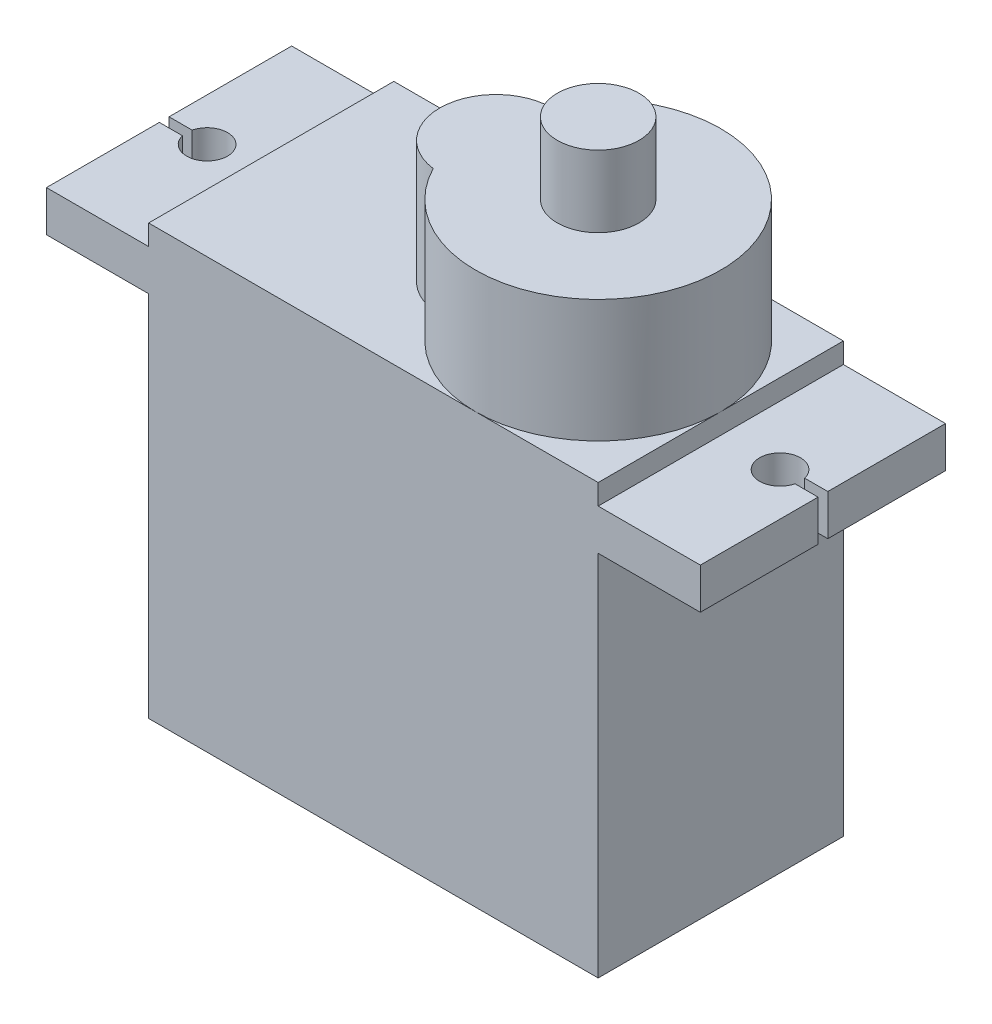
ISO-10303-21;
HEADER;
FILE_DESCRIPTION(('STEP AP214'),'2;1');
FILE_NAME('part.step','',(''),(''),'','','');
FILE_SCHEMA(('AUTOMOTIVE_DESIGN { 1 0 10303 214 1 1 1 1 }'));
ENDSEC;
DATA;
#1=APPLICATION_CONTEXT('core data for automotive mechanical design processes');
#2=APPLICATION_PROTOCOL_DEFINITION('international standard','automotive_design',2000,#1);
#3=PRODUCT_CONTEXT('',#1,'mechanical');
#4=PRODUCT('Part','Part','',(#3));
#5=PRODUCT_RELATED_PRODUCT_CATEGORY('part','',(#4));
#6=PRODUCT_DEFINITION_FORMATION('','',#4);
#7=PRODUCT_DEFINITION_CONTEXT('part definition',#1,'design');
#8=PRODUCT_DEFINITION('design','',#6,#7);
#9=PRODUCT_DEFINITION_SHAPE('','',#8);
#10=(LENGTH_UNIT() NAMED_UNIT(*) SI_UNIT(.MILLI.,.METRE.));
#11=(NAMED_UNIT(*) PLANE_ANGLE_UNIT() SI_UNIT($,.RADIAN.));
#12=(NAMED_UNIT(*) SI_UNIT($,.STERADIAN.) SOLID_ANGLE_UNIT());
#13=UNCERTAINTY_MEASURE_WITH_UNIT(LENGTH_MEASURE(1.E-05),#10,'distance_accuracy_value','');
#14=(GEOMETRIC_REPRESENTATION_CONTEXT(3) GLOBAL_UNCERTAINTY_ASSIGNED_CONTEXT((#13)) GLOBAL_UNIT_ASSIGNED_CONTEXT((#10,
#11,#12)) REPRESENTATION_CONTEXT('',''));
#15=CARTESIAN_POINT('',(0.,0.,0.));
#16=DIRECTION('',(0.,0.,1.));
#17=DIRECTION('',(1.,0.,0.));
#18=AXIS2_PLACEMENT_3D('',#15,#16,#17);
#19=CARTESIAN_POINT('',(-11.,11.,12.));
#20=DIRECTION('',(0.,-1.,0.));
#21=DIRECTION('',(0.,0.,-1.));
#22=AXIS2_PLACEMENT_3D('',#19,#20,#21);
#23=PLANE('',#22);
#24=CARTESIAN_POINT('',(0.,11.,6.));
#25=DIRECTION('',(0.,1.,0.));
#26=DIRECTION('',(0.,0.,1.));
#27=AXIS2_PLACEMENT_3D('',#24,#25,#26);
#28=CIRCLE('',#27,2.75);
#29=CARTESIAN_POINT('',(-0.343750000000005,11.,3.27156896046464));
#30=VERTEX_POINT('',#29);
#31=CARTESIAN_POINT('',(-0.343750000000006,11.,8.72843103953536));
#32=VERTEX_POINT('',#31);
#33=EDGE_CURVE('E215',#30,#32,#28,.T.);
#34=ORIENTED_EDGE('',*,*,#33,.F.);
#35=CARTESIAN_POINT('',(5.,11.,6.));
#36=DIRECTION('',(0.,1.,0.));
#37=DIRECTION('',(0.,0.,1.));
#38=AXIS2_PLACEMENT_3D('',#35,#36,#37);
#39=CIRCLE('',#38,6.);
#40=CARTESIAN_POINT('',(5.,11.,0.));
#41=VERTEX_POINT('',#40);
#42=EDGE_CURVE('E367',#41,#30,#39,.T.);
#43=ORIENTED_EDGE('',*,*,#42,.F.);
#44=DIRECTION('',(-1.,0.,0.));
#45=VECTOR('',#44,1.);
#46=CARTESIAN_POINT('',(-11.,11.,0.));
#47=LINE('',#46,#45);
#48=CARTESIAN_POINT('',(-11.,11.,0.));
#49=VERTEX_POINT('',#48);
#50=EDGE_CURVE('E304',#41,#49,#47,.T.);
#51=ORIENTED_EDGE('',*,*,#50,.T.);
#52=DIRECTION('',(0.,0.,-1.));
#53=VECTOR('',#52,1.);
#54=CARTESIAN_POINT('',(-11.,11.,12.));
#55=LINE('',#54,#53);
#56=CARTESIAN_POINT('',(-11.,11.,12.));
#57=VERTEX_POINT('',#56);
#58=EDGE_CURVE('E358',#57,#49,#55,.T.);
#59=ORIENTED_EDGE('',*,*,#58,.F.);
#60=DIRECTION('',(-1.,0.,0.));
#61=VECTOR('',#60,1.);
#62=CARTESIAN_POINT('',(-11.,11.,12.));
#63=LINE('',#62,#61);
#64=CARTESIAN_POINT('',(5.,11.,12.));
#65=VERTEX_POINT('',#64);
#66=EDGE_CURVE('E276',#65,#57,#63,.T.);
#67=ORIENTED_EDGE('',*,*,#66,.F.);
#68=EDGE_CURVE('E49',#32,#65,#39,.T.);
#69=ORIENTED_EDGE('',*,*,#68,.F.);
#70=EDGE_LOOP('',(#34,#43,#51,#59,#67,#69));
#71=FACE_BOUND('',#70,.T.);
#72=ADVANCED_FACE('F38',(#71),#23,.F.);
#73=CARTESIAN_POINT('',(11.,11.,6.));
#74=VERTEX_POINT('',#73);
#75=EDGE_CURVE('E11',#65,#74,#39,.T.);
#76=ORIENTED_EDGE('',*,*,#75,.F.);
#77=CARTESIAN_POINT('',(11.,11.,12.));
#78=VERTEX_POINT('',#77);
#79=EDGE_CURVE('E277',#78,#65,#63,.T.);
#80=ORIENTED_EDGE('',*,*,#79,.F.);
#81=DIRECTION('',(0.,0.,-1.));
#82=VECTOR('',#81,1.);
#83=CARTESIAN_POINT('',(11.,11.,12.));
#84=LINE('',#83,#82);
#85=EDGE_CURVE('E361',#78,#74,#84,.T.);
#86=ORIENTED_EDGE('',*,*,#85,.T.);
#87=EDGE_LOOP('',(#76,#80,#86));
#88=FACE_BOUND('',#87,.T.);
#89=ADVANCED_FACE('F412',(#88),#23,.F.);
#90=CARTESIAN_POINT('',(-16.,9.99999999999999,12.));
#91=DIRECTION('',(1.,0.,0.));
#92=DIRECTION('',(0.,0.,-1.));
#93=AXIS2_PLACEMENT_3D('',#90,#91,#92);
#94=PLANE('',#93);
#95=DIRECTION('',(0.,0.,-1.));
#96=VECTOR('',#95,1.);
#97=CARTESIAN_POINT('',(-16.,9.99999999999999,12.));
#98=LINE('',#97,#96);
#99=CARTESIAN_POINT('',(-16.,9.99999999999999,12.));
#100=VERTEX_POINT('',#99);
#101=CARTESIAN_POINT('',(-16.,9.99999999999998,6.47573964591907));
#102=VERTEX_POINT('',#101);
#103=EDGE_CURVE('E352',#100,#102,#98,.T.);
#104=ORIENTED_EDGE('',*,*,#103,.T.);
#105=DIRECTION('',(0.,1.,0.));
#106=VECTOR('',#105,1.);
#107=CARTESIAN_POINT('',(-16.,-10.001,6.47573964591907));
#108=LINE('',#107,#106);
#109=CARTESIAN_POINT('',(-16.,7.99999999999999,6.47573964591907));
#110=VERTEX_POINT('',#109);
#111=EDGE_CURVE('E241',#110,#102,#108,.T.);
#112=ORIENTED_EDGE('',*,*,#111,.F.);
#113=DIRECTION('',(0.,0.,-1.));
#114=VECTOR('',#113,1.);
#115=CARTESIAN_POINT('',(-16.,7.99999999999999,12.));
#116=LINE('',#115,#114);
#117=CARTESIAN_POINT('',(-16.,7.99999999999999,12.));
#118=VERTEX_POINT('',#117);
#119=EDGE_CURVE('E348',#118,#110,#116,.T.);
#120=ORIENTED_EDGE('',*,*,#119,.F.);
#121=DIRECTION('',(0.,-1.,0.));
#122=VECTOR('',#121,1.);
#123=CARTESIAN_POINT('',(-16.,9.99999999999999,12.));
#124=LINE('',#123,#122);
#125=EDGE_CURVE('E284',#100,#118,#124,.T.);
#126=ORIENTED_EDGE('',*,*,#125,.F.);
#127=EDGE_LOOP('',(#104,#112,#120,#126));
#128=FACE_BOUND('',#127,.T.);
#129=ADVANCED_FACE('F417',(#128),#94,.F.);
#130=CARTESIAN_POINT('',(16.,9.99999999999999,12.));
#131=DIRECTION('',(-1.,0.,0.));
#132=DIRECTION('',(0.,0.,1.));
#133=AXIS2_PLACEMENT_3D('',#130,#131,#132);
#134=PLANE('',#133);
#135=DIRECTION('',(0.,0.,-1.));
#136=VECTOR('',#135,1.);
#137=CARTESIAN_POINT('',(16.,9.99999999999999,12.));
#138=LINE('',#137,#136);
#139=CARTESIAN_POINT('',(16.,10.,5.76213017704046));
#140=VERTEX_POINT('',#139);
#141=CARTESIAN_POINT('',(16.,9.99999999999999,0.));
#142=VERTEX_POINT('',#141);
#143=EDGE_CURVE('E298',#140,#142,#138,.T.);
#144=ORIENTED_EDGE('',*,*,#143,.F.);
#145=DIRECTION('',(0.,1.,0.));
#146=VECTOR('',#145,1.);
#147=CARTESIAN_POINT('',(16.,-10.001,5.76213017704046));
#148=LINE('',#147,#146);
#149=CARTESIAN_POINT('',(16.,7.99999999999999,5.76213017704046));
#150=VERTEX_POINT('',#149);
#151=EDGE_CURVE('E262',#150,#140,#148,.T.);
#152=ORIENTED_EDGE('',*,*,#151,.F.);
#153=DIRECTION('',(0.,0.,-1.));
#154=VECTOR('',#153,1.);
#155=CARTESIAN_POINT('',(16.,7.99999999999999,12.));
#156=LINE('',#155,#154);
#157=CARTESIAN_POINT('',(16.,7.99999999999999,0.));
#158=VERTEX_POINT('',#157);
#159=EDGE_CURVE('E331',#150,#158,#156,.T.);
#160=ORIENTED_EDGE('',*,*,#159,.T.);
#161=DIRECTION('',(0.,1.,0.));
#162=VECTOR('',#161,1.);
#163=CARTESIAN_POINT('',(16.,9.99999999999999,0.));
#164=LINE('',#163,#162);
#165=EDGE_CURVE('E274',#158,#142,#164,.T.);
#166=ORIENTED_EDGE('',*,*,#165,.T.);
#167=EDGE_LOOP('',(#144,#152,#160,#166));
#168=FACE_BOUND('',#167,.T.);
#169=ADVANCED_FACE('F428',(#168),#134,.F.);
#170=CARTESIAN_POINT('',(16.,9.99999999999999,12.));
#171=DIRECTION('',(0.,-1.,0.));
#172=DIRECTION('',(0.,0.,-1.));
#173=AXIS2_PLACEMENT_3D('',#170,#171,#172);
#174=PLANE('',#173);
#175=CARTESIAN_POINT('',(13.9005012794919,10.,6.));
#176=DIRECTION('',(0.,1.,0.));
#177=DIRECTION('',(1.,0.,0.));
#178=AXIS2_PLACEMENT_3D('',#175,#176,#177);
#179=CIRCLE('',#178,1.);
#180=CARTESIAN_POINT('',(14.8717983233076,10.,5.76213017704046));
#181=VERTEX_POINT('',#180);
#182=CARTESIAN_POINT('',(14.8717983233076,10.,6.23786982295953));
#183=VERTEX_POINT('',#182);
#184=EDGE_CURVE('E251',#181,#183,#179,.T.);
#185=ORIENTED_EDGE('',*,*,#184,.F.);
#186=DIRECTION('',(-1.,0.,0.));
#187=VECTOR('',#186,1.);
#188=CARTESIAN_POINT('',(16.,10.,5.76213017704046));
#189=LINE('',#188,#187);
#190=EDGE_CURVE('E256',#140,#181,#189,.T.);
#191=ORIENTED_EDGE('',*,*,#190,.F.);
#192=ORIENTED_EDGE('',*,*,#143,.T.);
#193=DIRECTION('',(-1.,0.,0.));
#194=VECTOR('',#193,1.);
#195=CARTESIAN_POINT('',(16.,9.99999999999999,0.));
#196=LINE('',#195,#194);
#197=CARTESIAN_POINT('',(11.,9.99999999999999,0.));
#198=VERTEX_POINT('',#197);
#199=EDGE_CURVE('E248',#142,#198,#196,.T.);
#200=ORIENTED_EDGE('',*,*,#199,.T.);
#201=DIRECTION('',(0.,0.,-1.));
#202=VECTOR('',#201,1.);
#203=CARTESIAN_POINT('',(11.,9.99999999999999,12.));
#204=LINE('',#203,#202);
#205=CARTESIAN_POINT('',(11.,9.99999999999999,12.));
#206=VERTEX_POINT('',#205);
#207=EDGE_CURVE('E42',#206,#198,#204,.T.);
#208=ORIENTED_EDGE('',*,*,#207,.F.);
#209=DIRECTION('',(-1.,0.,0.));
#210=VECTOR('',#209,1.);
#211=CARTESIAN_POINT('',(16.,9.99999999999999,12.));
#212=LINE('',#211,#210);
#213=CARTESIAN_POINT('',(16.,9.99999999999999,12.));
#214=VERTEX_POINT('',#213);
#215=EDGE_CURVE('E270',#214,#206,#212,.T.);
#216=ORIENTED_EDGE('',*,*,#215,.F.);
#217=CARTESIAN_POINT('',(16.,9.99999999999999,6.23786982295953));
#218=VERTEX_POINT('',#217);
#219=EDGE_CURVE('E328',#214,#218,#138,.T.);
#220=ORIENTED_EDGE('',*,*,#219,.T.);
#221=DIRECTION('',(1.,0.,0.));
#222=VECTOR('',#221,1.);
#223=CARTESIAN_POINT('',(16.,10.,6.23786982295953));
#224=LINE('',#223,#222);
#225=EDGE_CURVE('E254',#183,#218,#224,.T.);
#226=ORIENTED_EDGE('',*,*,#225,.F.);
#227=EDGE_LOOP('',(#185,#191,#192,#200,#208,#216,#220,#226));
#228=FACE_BOUND('',#227,.T.);
#229=ADVANCED_FACE('F40',(#228),#174,.F.);
#230=CARTESIAN_POINT('',(11.,9.99999999999999,12.));
#231=DIRECTION('',(-1.,0.,0.));
#232=DIRECTION('',(0.,-1.,0.));
#233=AXIS2_PLACEMENT_3D('',#230,#231,#232);
#234=PLANE('',#233);
#235=DIRECTION('',(0.,1.,0.));
#236=VECTOR('',#235,1.);
#237=CARTESIAN_POINT('',(11.,9.99999999999999,0.));
#238=LINE('',#237,#236);
#239=CARTESIAN_POINT('',(11.,11.,0.));
#240=VERTEX_POINT('',#239);
#241=EDGE_CURVE('E301',#198,#240,#238,.T.);
#242=ORIENTED_EDGE('',*,*,#241,.T.);
#243=EDGE_CURVE('E360',#74,#240,#84,.T.);
#244=ORIENTED_EDGE('',*,*,#243,.F.);
#245=ORIENTED_EDGE('',*,*,#85,.F.);
#246=DIRECTION('',(0.,1.,0.));
#247=VECTOR('',#246,1.);
#248=CARTESIAN_POINT('',(11.,9.99999999999999,12.));
#249=LINE('',#248,#247);
#250=EDGE_CURVE('E273',#206,#78,#249,.T.);
#251=ORIENTED_EDGE('',*,*,#250,.F.);
#252=ORIENTED_EDGE('',*,*,#207,.T.);
#253=EDGE_LOOP('',(#242,#244,#245,#251,#252));
#254=FACE_BOUND('',#253,.T.);
#255=ADVANCED_FACE('F371',(#254),#234,.F.);
#256=EDGE_CURVE('E47',#74,#41,#39,.T.);
#257=ORIENTED_EDGE('',*,*,#256,.F.);
#258=ORIENTED_EDGE('',*,*,#243,.T.);
#259=EDGE_CURVE('E305',#240,#41,#47,.T.);
#260=ORIENTED_EDGE('',*,*,#259,.T.);
#261=EDGE_LOOP('',(#257,#258,#260));
#262=FACE_BOUND('',#261,.T.);
#263=ADVANCED_FACE('F368',(#262),#23,.F.);
#264=CARTESIAN_POINT('',(-11.,9.99999999999999,12.));
#265=DIRECTION('',(1.,0.,0.));
#266=DIRECTION('',(0.,1.,0.));
#267=AXIS2_PLACEMENT_3D('',#264,#265,#266);
#268=PLANE('',#267);
#269=DIRECTION('',(0.,-1.,0.));
#270=VECTOR('',#269,1.);
#271=CARTESIAN_POINT('',(-11.,9.99999999999999,0.));
#272=LINE('',#271,#270);
#273=CARTESIAN_POINT('',(-11.,9.99999999999999,0.));
#274=VERTEX_POINT('',#273);
#275=EDGE_CURVE('E307',#49,#274,#272,.T.);
#276=ORIENTED_EDGE('',*,*,#275,.T.);
#277=DIRECTION('',(0.,0.,-1.));
#278=VECTOR('',#277,1.);
#279=CARTESIAN_POINT('',(-11.,9.99999999999999,12.));
#280=LINE('',#279,#278);
#281=CARTESIAN_POINT('',(-11.,9.99999999999999,12.));
#282=VERTEX_POINT('',#281);
#283=EDGE_CURVE('E355',#282,#274,#280,.T.);
#284=ORIENTED_EDGE('',*,*,#283,.F.);
#285=DIRECTION('',(0.,-1.,0.));
#286=VECTOR('',#285,1.);
#287=CARTESIAN_POINT('',(-11.,9.99999999999999,12.));
#288=LINE('',#287,#286);
#289=EDGE_CURVE('E280',#57,#282,#288,.T.);
#290=ORIENTED_EDGE('',*,*,#289,.F.);
#291=ORIENTED_EDGE('',*,*,#58,.T.);
#292=EDGE_LOOP('',(#276,#284,#290,#291));
#293=FACE_BOUND('',#292,.T.);
#294=ADVANCED_FACE('F382',(#293),#268,.F.);
#295=CARTESIAN_POINT('',(-16.,9.99999999999999,12.));
#296=DIRECTION('',(0.,-1.,0.));
#297=DIRECTION('',(0.,0.,-1.));
#298=AXIS2_PLACEMENT_3D('',#295,#296,#297);
#299=PLANE('',#298);
#300=CARTESIAN_POINT('',(-13.9005012794919,9.99999999999998,6.23786982295953));
#301=DIRECTION('',(0.,1.,0.));
#302=DIRECTION('',(-1.,0.,0.));
#303=AXIS2_PLACEMENT_3D('',#300,#301,#302);
#304=CIRCLE('',#303,1.);
#305=CARTESIAN_POINT('',(-14.8717983233076,9.99999999999998,6.47573964591907));
#306=VERTEX_POINT('',#305);
#307=CARTESIAN_POINT('',(-14.8717983233076,9.99999999999998,6.));
#308=VERTEX_POINT('',#307);
#309=EDGE_CURVE('E229',#306,#308,#304,.T.);
#310=ORIENTED_EDGE('',*,*,#309,.F.);
#311=DIRECTION('',(1.,0.,0.));
#312=VECTOR('',#311,1.);
#313=CARTESIAN_POINT('',(-16.,9.99999999999998,6.47573964591907));
#314=LINE('',#313,#312);
#315=EDGE_CURVE('E234',#102,#306,#314,.T.);
#316=ORIENTED_EDGE('',*,*,#315,.F.);
#317=ORIENTED_EDGE('',*,*,#103,.F.);
#318=DIRECTION('',(-1.,0.,0.));
#319=VECTOR('',#318,1.);
#320=CARTESIAN_POINT('',(-16.,9.99999999999999,12.));
#321=LINE('',#320,#319);
#322=EDGE_CURVE('E282',#282,#100,#321,.T.);
#323=ORIENTED_EDGE('',*,*,#322,.F.);
#324=ORIENTED_EDGE('',*,*,#283,.T.);
#325=DIRECTION('',(-1.,0.,0.));
#326=VECTOR('',#325,1.);
#327=CARTESIAN_POINT('',(-16.,9.99999999999999,0.));
#328=LINE('',#327,#326);
#329=CARTESIAN_POINT('',(-16.,9.99999999999999,0.));
#330=VERTEX_POINT('',#329);
#331=EDGE_CURVE('E309',#274,#330,#328,.T.);
#332=ORIENTED_EDGE('',*,*,#331,.T.);
#333=CARTESIAN_POINT('',(-16.,9.99999999999998,6.));
#334=VERTEX_POINT('',#333);
#335=EDGE_CURVE('E351',#334,#330,#98,.T.);
#336=ORIENTED_EDGE('',*,*,#335,.F.);
#337=DIRECTION('',(-1.,0.,0.));
#338=VECTOR('',#337,1.);
#339=CARTESIAN_POINT('',(-16.,9.99999999999998,6.));
#340=LINE('',#339,#338);
#341=EDGE_CURVE('E232',#308,#334,#340,.T.);
#342=ORIENTED_EDGE('',*,*,#341,.F.);
#343=EDGE_LOOP('',(#310,#316,#317,#323,#324,#332,#336,#342));
#344=FACE_BOUND('',#343,.T.);
#345=ADVANCED_FACE('F424',(#344),#299,.F.);
#346=CARTESIAN_POINT('',(-16.,7.99999999999999,6.));
#347=VERTEX_POINT('',#346);
#348=CARTESIAN_POINT('',(-16.,7.99999999999999,0.));
#349=VERTEX_POINT('',#348);
#350=EDGE_CURVE('E347',#347,#349,#116,.T.);
#351=ORIENTED_EDGE('',*,*,#350,.F.);
#352=DIRECTION('',(0.,1.,0.));
#353=VECTOR('',#352,1.);
#354=CARTESIAN_POINT('',(-16.,-10.001,6.));
#355=LINE('',#354,#353);
#356=EDGE_CURVE('E243',#347,#334,#355,.T.);
#357=ORIENTED_EDGE('',*,*,#356,.T.);
#358=ORIENTED_EDGE('',*,*,#335,.T.);
#359=DIRECTION('',(0.,-1.,0.));
#360=VECTOR('',#359,1.);
#361=CARTESIAN_POINT('',(-16.,9.99999999999999,0.));
#362=LINE('',#361,#360);
#363=EDGE_CURVE('E312',#330,#349,#362,.T.);
#364=ORIENTED_EDGE('',*,*,#363,.T.);
#365=EDGE_LOOP('',(#351,#357,#358,#364));
#366=FACE_BOUND('',#365,.T.);
#367=ADVANCED_FACE('F499',(#366),#94,.F.);
#368=CARTESIAN_POINT('',(-16.,7.99999999999999,12.));
#369=DIRECTION('',(0.,1.,0.));
#370=DIRECTION('',(-1.,0.,0.));
#371=AXIS2_PLACEMENT_3D('',#368,#369,#370);
#372=PLANE('',#371);
#373=ORIENTED_EDGE('',*,*,#119,.T.);
#374=DIRECTION('',(-1.,0.,0.));
#375=VECTOR('',#374,1.);
#376=CARTESIAN_POINT('',(-16.,7.99999999999999,6.47573964591907));
#377=LINE('',#376,#375);
#378=CARTESIAN_POINT('',(-14.8717983233076,7.99999999999999,6.47573964591907));
#379=VERTEX_POINT('',#378);
#380=EDGE_CURVE('E226',#379,#110,#377,.T.);
#381=ORIENTED_EDGE('',*,*,#380,.F.);
#382=CARTESIAN_POINT('',(-13.9005012794919,7.99999999999999,6.23786982295953));
#383=DIRECTION('',(0.,1.,0.));
#384=DIRECTION('',(-1.,0.,0.));
#385=AXIS2_PLACEMENT_3D('',#382,#383,#384);
#386=CIRCLE('',#385,1.);
#387=CARTESIAN_POINT('',(-14.8717983233076,7.99999999999999,6.));
#388=VERTEX_POINT('',#387);
#389=EDGE_CURVE('E223',#388,#379,#386,.F.);
#390=ORIENTED_EDGE('',*,*,#389,.F.);
#391=DIRECTION('',(1.,0.,0.));
#392=VECTOR('',#391,1.);
#393=CARTESIAN_POINT('',(-16.,7.99999999999999,6.));
#394=LINE('',#393,#392);
#395=EDGE_CURVE('E240',#347,#388,#394,.T.);
#396=ORIENTED_EDGE('',*,*,#395,.F.);
#397=ORIENTED_EDGE('',*,*,#350,.T.);
#398=DIRECTION('',(1.,0.,0.));
#399=VECTOR('',#398,1.);
#400=CARTESIAN_POINT('',(-16.,7.99999999999999,0.));
#401=LINE('',#400,#399);
#402=CARTESIAN_POINT('',(-11.,7.99999999999999,0.));
#403=VERTEX_POINT('',#402);
#404=EDGE_CURVE('E315',#349,#403,#401,.T.);
#405=ORIENTED_EDGE('',*,*,#404,.T.);
#406=DIRECTION('',(0.,0.,-1.));
#407=VECTOR('',#406,1.);
#408=CARTESIAN_POINT('',(-11.,7.99999999999999,12.));
#409=LINE('',#408,#407);
#410=CARTESIAN_POINT('',(-11.,7.99999999999999,12.));
#411=VERTEX_POINT('',#410);
#412=EDGE_CURVE('E344',#411,#403,#409,.T.);
#413=ORIENTED_EDGE('',*,*,#412,.F.);
#414=DIRECTION('',(1.,0.,0.));
#415=VECTOR('',#414,1.);
#416=CARTESIAN_POINT('',(-16.,7.99999999999999,12.));
#417=LINE('',#416,#415);
#418=EDGE_CURVE('E286',#118,#411,#417,.T.);
#419=ORIENTED_EDGE('',*,*,#418,.F.);
#420=EDGE_LOOP('',(#373,#381,#390,#396,#397,#405,#413,#419));
#421=FACE_BOUND('',#420,.T.);
#422=ADVANCED_FACE('F495',(#421),#372,.F.);
#423=CARTESIAN_POINT('',(-11.,7.99999999999999,12.));
#424=DIRECTION('',(1.,0.,0.));
#425=DIRECTION('',(0.,1.,0.));
#426=AXIS2_PLACEMENT_3D('',#423,#424,#425);
#427=PLANE('',#426);
#428=DIRECTION('',(0.,-1.,0.));
#429=VECTOR('',#428,1.);
#430=CARTESIAN_POINT('',(-11.,7.99999999999999,0.));
#431=LINE('',#430,#429);
#432=CARTESIAN_POINT('',(-11.,-10.,0.));
#433=VERTEX_POINT('',#432);
#434=EDGE_CURVE('E317',#403,#433,#431,.T.);
#435=ORIENTED_EDGE('',*,*,#434,.T.);
#436=DIRECTION('',(0.,0.,-1.));
#437=VECTOR('',#436,1.);
#438=CARTESIAN_POINT('',(-11.,-10.,12.));
#439=LINE('',#438,#437);
#440=CARTESIAN_POINT('',(-11.,-10.,12.));
#441=VERTEX_POINT('',#440);
#442=EDGE_CURVE('E341',#441,#433,#439,.T.);
#443=ORIENTED_EDGE('',*,*,#442,.F.);
#444=DIRECTION('',(0.,-1.,0.));
#445=VECTOR('',#444,1.);
#446=CARTESIAN_POINT('',(-11.,7.99999999999999,12.));
#447=LINE('',#446,#445);
#448=EDGE_CURVE('E288',#411,#441,#447,.T.);
#449=ORIENTED_EDGE('',*,*,#448,.F.);
#450=ORIENTED_EDGE('',*,*,#412,.T.);
#451=EDGE_LOOP('',(#435,#443,#449,#450));
#452=FACE_BOUND('',#451,.T.);
#453=ADVANCED_FACE('F491',(#452),#427,.F.);
#454=CARTESIAN_POINT('',(-11.,-10.,12.));
#455=DIRECTION('',(0.,1.,0.));
#456=DIRECTION('',(0.,0.,1.));
#457=AXIS2_PLACEMENT_3D('',#454,#455,#456);
#458=PLANE('',#457);
#459=DIRECTION('',(1.,0.,0.));
#460=VECTOR('',#459,1.);
#461=CARTESIAN_POINT('',(-11.,-10.,0.));
#462=LINE('',#461,#460);
#463=CARTESIAN_POINT('',(11.,-10.,0.));
#464=VERTEX_POINT('',#463);
#465=EDGE_CURVE('E319',#433,#464,#462,.T.);
#466=ORIENTED_EDGE('',*,*,#465,.T.);
#467=DIRECTION('',(0.,0.,-1.));
#468=VECTOR('',#467,1.);
#469=CARTESIAN_POINT('',(11.,-10.,12.));
#470=LINE('',#469,#468);
#471=CARTESIAN_POINT('',(11.,-10.,12.));
#472=VERTEX_POINT('',#471);
#473=EDGE_CURVE('E338',#472,#464,#470,.T.);
#474=ORIENTED_EDGE('',*,*,#473,.F.);
#475=DIRECTION('',(1.,0.,0.));
#476=VECTOR('',#475,1.);
#477=CARTESIAN_POINT('',(-11.,-10.,12.));
#478=LINE('',#477,#476);
#479=EDGE_CURVE('E290',#441,#472,#478,.T.);
#480=ORIENTED_EDGE('',*,*,#479,.F.);
#481=ORIENTED_EDGE('',*,*,#442,.T.);
#482=EDGE_LOOP('',(#466,#474,#480,#481));
#483=FACE_BOUND('',#482,.T.);
#484=ADVANCED_FACE('F487',(#483),#458,.F.);
#485=CARTESIAN_POINT('',(11.,7.99999999999999,12.));
#486=DIRECTION('',(-1.,0.,0.));
#487=DIRECTION('',(0.,-1.,0.));
#488=AXIS2_PLACEMENT_3D('',#485,#486,#487);
#489=PLANE('',#488);
#490=DIRECTION('',(0.,1.,0.));
#491=VECTOR('',#490,1.);
#492=CARTESIAN_POINT('',(11.,7.99999999999999,0.));
#493=LINE('',#492,#491);
#494=CARTESIAN_POINT('',(11.,7.99999999999999,0.));
#495=VERTEX_POINT('',#494);
#496=EDGE_CURVE('E321',#464,#495,#493,.T.);
#497=ORIENTED_EDGE('',*,*,#496,.T.);
#498=DIRECTION('',(0.,0.,-1.));
#499=VECTOR('',#498,1.);
#500=CARTESIAN_POINT('',(11.,7.99999999999999,12.));
#501=LINE('',#500,#499);
#502=CARTESIAN_POINT('',(11.,7.99999999999999,12.));
#503=VERTEX_POINT('',#502);
#504=EDGE_CURVE('E335',#503,#495,#501,.T.);
#505=ORIENTED_EDGE('',*,*,#504,.F.);
#506=DIRECTION('',(0.,1.,0.));
#507=VECTOR('',#506,1.);
#508=CARTESIAN_POINT('',(11.,7.99999999999999,12.));
#509=LINE('',#508,#507);
#510=EDGE_CURVE('E292',#472,#503,#509,.T.);
#511=ORIENTED_EDGE('',*,*,#510,.F.);
#512=ORIENTED_EDGE('',*,*,#473,.T.);
#513=EDGE_LOOP('',(#497,#505,#511,#512));
#514=FACE_BOUND('',#513,.T.);
#515=ADVANCED_FACE('F484',(#514),#489,.F.);
#516=CARTESIAN_POINT('',(16.,7.99999999999999,12.));
#517=DIRECTION('',(0.,1.,0.));
#518=DIRECTION('',(-1.,0.,0.));
#519=AXIS2_PLACEMENT_3D('',#516,#517,#518);
#520=PLANE('',#519);
#521=ORIENTED_EDGE('',*,*,#159,.F.);
#522=DIRECTION('',(1.,0.,0.));
#523=VECTOR('',#522,1.);
#524=CARTESIAN_POINT('',(16.,7.99999999999999,5.76213017704046));
#525=LINE('',#524,#523);
#526=CARTESIAN_POINT('',(14.8717983233076,7.99999999999999,5.76213017704046));
#527=VERTEX_POINT('',#526);
#528=EDGE_CURVE('E219',#527,#150,#525,.T.);
#529=ORIENTED_EDGE('',*,*,#528,.F.);
#530=CARTESIAN_POINT('',(13.9005012794919,7.99999999999999,6.));
#531=DIRECTION('',(0.,1.,0.));
#532=DIRECTION('',(-1.,0.,0.));
#533=AXIS2_PLACEMENT_3D('',#530,#531,#532);
#534=CIRCLE('',#533,1.);
#535=CARTESIAN_POINT('',(14.8717983233076,7.99999999999999,6.23786982295953));
#536=VERTEX_POINT('',#535);
#537=EDGE_CURVE('E216',#536,#527,#534,.F.);
#538=ORIENTED_EDGE('',*,*,#537,.F.);
#539=DIRECTION('',(-1.,0.,0.));
#540=VECTOR('',#539,1.);
#541=CARTESIAN_POINT('',(16.,7.99999999999999,6.23786982295953));
#542=LINE('',#541,#540);
#543=CARTESIAN_POINT('',(16.,7.99999999999999,6.23786982295953));
#544=VERTEX_POINT('',#543);
#545=EDGE_CURVE('E227',#544,#536,#542,.T.);
#546=ORIENTED_EDGE('',*,*,#545,.F.);
#547=CARTESIAN_POINT('',(16.,7.99999999999999,12.));
#548=VERTEX_POINT('',#547);
#549=EDGE_CURVE('E332',#548,#544,#156,.T.);
#550=ORIENTED_EDGE('',*,*,#549,.F.);
#551=DIRECTION('',(1.,0.,0.));
#552=VECTOR('',#551,1.);
#553=CARTESIAN_POINT('',(16.,7.99999999999999,12.));
#554=LINE('',#553,#552);
#555=EDGE_CURVE('E294',#503,#548,#554,.T.);
#556=ORIENTED_EDGE('',*,*,#555,.F.);
#557=ORIENTED_EDGE('',*,*,#504,.T.);
#558=DIRECTION('',(1.,0.,0.));
#559=VECTOR('',#558,1.);
#560=CARTESIAN_POINT('',(16.,7.99999999999999,0.));
#561=LINE('',#560,#559);
#562=EDGE_CURVE('E323',#495,#158,#561,.T.);
#563=ORIENTED_EDGE('',*,*,#562,.T.);
#564=EDGE_LOOP('',(#521,#529,#538,#546,#550,#556,#557,#563));
#565=FACE_BOUND('',#564,.T.);
#566=ADVANCED_FACE('F449',(#565),#520,.F.);
#567=ORIENTED_EDGE('',*,*,#549,.T.);
#568=DIRECTION('',(0.,1.,0.));
#569=VECTOR('',#568,1.);
#570=CARTESIAN_POINT('',(16.,-10.001,6.23786982295953));
#571=LINE('',#570,#569);
#572=EDGE_CURVE('E264',#544,#218,#571,.T.);
#573=ORIENTED_EDGE('',*,*,#572,.T.);
#574=ORIENTED_EDGE('',*,*,#219,.F.);
#575=DIRECTION('',(0.,1.,0.));
#576=VECTOR('',#575,1.);
#577=CARTESIAN_POINT('',(16.,9.99999999999999,12.));
#578=LINE('',#577,#576);
#579=EDGE_CURVE('E296',#548,#214,#578,.T.);
#580=ORIENTED_EDGE('',*,*,#579,.F.);
#581=EDGE_LOOP('',(#567,#573,#574,#580));
#582=FACE_BOUND('',#581,.T.);
#583=ADVANCED_FACE('F435',(#582),#134,.F.);
#584=CARTESIAN_POINT('',(0.,0.,12.));
#585=DIRECTION('',(0.,0.,-1.));
#586=DIRECTION('',(-1.,0.,0.));
#587=AXIS2_PLACEMENT_3D('',#584,#585,#586);
#588=PLANE('',#587);
#589=ORIENTED_EDGE('',*,*,#215,.T.);
#590=ORIENTED_EDGE('',*,*,#250,.T.);
#591=ORIENTED_EDGE('',*,*,#79,.T.);
#592=ORIENTED_EDGE('',*,*,#66,.T.);
#593=ORIENTED_EDGE('',*,*,#289,.T.);
#594=ORIENTED_EDGE('',*,*,#322,.T.);
#595=ORIENTED_EDGE('',*,*,#125,.T.);
#596=ORIENTED_EDGE('',*,*,#418,.T.);
#597=ORIENTED_EDGE('',*,*,#448,.T.);
#598=ORIENTED_EDGE('',*,*,#479,.T.);
#599=ORIENTED_EDGE('',*,*,#510,.T.);
#600=ORIENTED_EDGE('',*,*,#555,.T.);
#601=ORIENTED_EDGE('',*,*,#579,.T.);
#602=EDGE_LOOP('',(#589,#590,#591,#592,#593,#594,#595,#596,#597,#598,#599,#600,#601));
#603=FACE_BOUND('',#602,.T.);
#604=ADVANCED_FACE('F386',(#603),#588,.F.);
#605=CARTESIAN_POINT('',(0.,0.,0.));
#606=DIRECTION('',(0.,0.,-1.));
#607=DIRECTION('',(-1.,0.,0.));
#608=AXIS2_PLACEMENT_3D('',#605,#606,#607);
#609=PLANE('',#608);
#610=ORIENTED_EDGE('',*,*,#199,.F.);
#611=ORIENTED_EDGE('',*,*,#165,.F.);
#612=ORIENTED_EDGE('',*,*,#562,.F.);
#613=ORIENTED_EDGE('',*,*,#496,.F.);
#614=ORIENTED_EDGE('',*,*,#465,.F.);
#615=ORIENTED_EDGE('',*,*,#434,.F.);
#616=ORIENTED_EDGE('',*,*,#404,.F.);
#617=ORIENTED_EDGE('',*,*,#363,.F.);
#618=ORIENTED_EDGE('',*,*,#331,.F.);
#619=ORIENTED_EDGE('',*,*,#275,.F.);
#620=ORIENTED_EDGE('',*,*,#50,.F.);
#621=ORIENTED_EDGE('',*,*,#259,.F.);
#622=ORIENTED_EDGE('',*,*,#241,.F.);
#623=EDGE_LOOP('',(#610,#611,#612,#613,#614,#615,#616,#617,#618,#619,#620,#621,#622));
#624=FACE_BOUND('',#623,.T.);
#625=ADVANCED_FACE('F376',(#624),#609,.T.);
#626=CARTESIAN_POINT('',(13.9005012794919,-10.001,6.));
#627=DIRECTION('',(0.,1.,0.));
#628=DIRECTION('',(-1.,0.,0.));
#629=AXIS2_PLACEMENT_3D('',#626,#627,#628);
#630=CYLINDRICAL_SURFACE('',#629,1.);
#631=ORIENTED_EDGE('',*,*,#537,.T.);
#632=DIRECTION('',(0.,1.,0.));
#633=VECTOR('',#632,1.);
#634=CARTESIAN_POINT('',(14.8717983233076,-10.001,5.76213017704046));
#635=LINE('',#634,#633);
#636=EDGE_CURVE('E260',#527,#181,#635,.T.);
#637=ORIENTED_EDGE('',*,*,#636,.T.);
#638=ORIENTED_EDGE('',*,*,#184,.T.);
#639=DIRECTION('',(0.,1.,0.));
#640=VECTOR('',#639,1.);
#641=CARTESIAN_POINT('',(14.8717983233076,-10.001,6.23786982295953));
#642=LINE('',#641,#640);
#643=EDGE_CURVE('E259',#536,#183,#642,.T.);
#644=ORIENTED_EDGE('',*,*,#643,.F.);
#645=EDGE_LOOP('',(#631,#637,#638,#644));
#646=FACE_BOUND('',#645,.T.);
#647=ADVANCED_FACE('F441',(#646),#630,.F.);
#648=CARTESIAN_POINT('',(16.,-10.001,5.76213017704046));
#649=DIRECTION('',(0.,0.,-1.));
#650=DIRECTION('',(-1.,0.,0.));
#651=AXIS2_PLACEMENT_3D('',#648,#649,#650);
#652=PLANE('',#651);
#653=ORIENTED_EDGE('',*,*,#528,.T.);
#654=ORIENTED_EDGE('',*,*,#151,.T.);
#655=ORIENTED_EDGE('',*,*,#190,.T.);
#656=ORIENTED_EDGE('',*,*,#636,.F.);
#657=EDGE_LOOP('',(#653,#654,#655,#656));
#658=FACE_BOUND('',#657,.T.);
#659=ADVANCED_FACE('F445',(#658),#652,.F.);
#660=CARTESIAN_POINT('',(16.,-10.001,6.23786982295953));
#661=DIRECTION('',(0.,0.,1.));
#662=DIRECTION('',(1.,0.,0.));
#663=AXIS2_PLACEMENT_3D('',#660,#661,#662);
#664=PLANE('',#663);
#665=ORIENTED_EDGE('',*,*,#545,.T.);
#666=ORIENTED_EDGE('',*,*,#643,.T.);
#667=ORIENTED_EDGE('',*,*,#225,.T.);
#668=ORIENTED_EDGE('',*,*,#572,.F.);
#669=EDGE_LOOP('',(#665,#666,#667,#668));
#670=FACE_BOUND('',#669,.T.);
#671=ADVANCED_FACE('F462',(#670),#664,.F.);
#672=CARTESIAN_POINT('',(-13.9005012794918,-10.001,6.23786982295953));
#673=DIRECTION('',(0.,1.,0.));
#674=DIRECTION('',(-1.,0.,0.));
#675=AXIS2_PLACEMENT_3D('',#672,#673,#674);
#676=CYLINDRICAL_SURFACE('',#675,1.);
#677=ORIENTED_EDGE('',*,*,#389,.T.);
#678=DIRECTION('',(0.,1.,0.));
#679=VECTOR('',#678,1.);
#680=CARTESIAN_POINT('',(-14.8717983233076,-10.001,6.47573964591907));
#681=LINE('',#680,#679);
#682=EDGE_CURVE('E238',#379,#306,#681,.T.);
#683=ORIENTED_EDGE('',*,*,#682,.T.);
#684=ORIENTED_EDGE('',*,*,#309,.T.);
#685=DIRECTION('',(0.,1.,0.));
#686=VECTOR('',#685,1.);
#687=CARTESIAN_POINT('',(-14.8717983233076,-10.001,6.));
#688=LINE('',#687,#686);
#689=EDGE_CURVE('E237',#388,#308,#688,.T.);
#690=ORIENTED_EDGE('',*,*,#689,.F.);
#691=EDGE_LOOP('',(#677,#683,#684,#690));
#692=FACE_BOUND('',#691,.T.);
#693=ADVANCED_FACE('F464',(#692),#676,.F.);
#694=CARTESIAN_POINT('',(-16.,-10.001,6.47573964591907));
#695=DIRECTION('',(0.,0.,1.));
#696=DIRECTION('',(1.,0.,0.));
#697=AXIS2_PLACEMENT_3D('',#694,#695,#696);
#698=PLANE('',#697);
#699=ORIENTED_EDGE('',*,*,#380,.T.);
#700=ORIENTED_EDGE('',*,*,#111,.T.);
#701=ORIENTED_EDGE('',*,*,#315,.T.);
#702=ORIENTED_EDGE('',*,*,#682,.F.);
#703=EDGE_LOOP('',(#699,#700,#701,#702));
#704=FACE_BOUND('',#703,.T.);
#705=ADVANCED_FACE('F470',(#704),#698,.F.);
#706=CARTESIAN_POINT('',(-16.,-10.001,6.));
#707=DIRECTION('',(0.,0.,-1.));
#708=DIRECTION('',(-1.,0.,0.));
#709=AXIS2_PLACEMENT_3D('',#706,#707,#708);
#710=PLANE('',#709);
#711=ORIENTED_EDGE('',*,*,#395,.T.);
#712=ORIENTED_EDGE('',*,*,#689,.T.);
#713=ORIENTED_EDGE('',*,*,#341,.T.);
#714=ORIENTED_EDGE('',*,*,#356,.F.);
#715=EDGE_LOOP('',(#711,#712,#713,#714));
#716=FACE_BOUND('',#715,.T.);
#717=ADVANCED_FACE('F533',(#716),#710,.F.);
#718=CARTESIAN_POINT('',(0.,17.,6.));
#719=DIRECTION('',(0.,-1.,0.));
#720=DIRECTION('',(0.,0.,-1.));
#721=AXIS2_PLACEMENT_3D('',#718,#719,#720);
#722=CYLINDRICAL_SURFACE('',#721,2.75);
#723=ORIENTED_EDGE('',*,*,#33,.T.);
#724=DIRECTION('',(0.,-1.,0.));
#725=VECTOR('',#724,1.);
#726=CARTESIAN_POINT('',(-0.343750000000006,17.,8.72843103953536));
#727=LINE('',#726,#725);
#728=CARTESIAN_POINT('',(-0.343750000000006,17.,8.72843103953536));
#729=VERTEX_POINT('',#728);
#730=EDGE_CURVE('E202',#729,#32,#727,.T.);
#731=ORIENTED_EDGE('',*,*,#730,.F.);
#732=CARTESIAN_POINT('',(0.,17.,6.));
#733=DIRECTION('',(0.,1.,0.));
#734=DIRECTION('',(0.,0.,1.));
#735=AXIS2_PLACEMENT_3D('',#732,#733,#734);
#736=CIRCLE('',#735,2.75);
#737=CARTESIAN_POINT('',(-0.343750000000005,17.,3.27156896046464));
#738=VERTEX_POINT('',#737);
#739=EDGE_CURVE('E209',#738,#729,#736,.T.);
#740=ORIENTED_EDGE('',*,*,#739,.F.);
#741=DIRECTION('',(0.,-1.,0.));
#742=VECTOR('',#741,1.);
#743=CARTESIAN_POINT('',(-0.343750000000005,17.,3.27156896046464));
#744=LINE('',#743,#742);
#745=EDGE_CURVE('E206',#738,#30,#744,.T.);
#746=ORIENTED_EDGE('',*,*,#745,.T.);
#747=EDGE_LOOP('',(#723,#731,#740,#746));
#748=FACE_BOUND('',#747,.T.);
#749=ADVANCED_FACE('F214',(#748),#722,.T.);
#750=CARTESIAN_POINT('',(5.,17.,6.));
#751=DIRECTION('',(0.,-1.,0.));
#752=DIRECTION('',(0.,0.,-1.));
#753=AXIS2_PLACEMENT_3D('',#750,#751,#752);
#754=CYLINDRICAL_SURFACE('',#753,6.);
#755=ORIENTED_EDGE('',*,*,#68,.T.);
#756=ORIENTED_EDGE('',*,*,#75,.T.);
#757=ORIENTED_EDGE('',*,*,#256,.T.);
#758=ORIENTED_EDGE('',*,*,#42,.T.);
#759=ORIENTED_EDGE('',*,*,#745,.F.);
#760=CARTESIAN_POINT('',(5.,17.,6.));
#761=DIRECTION('',(0.,1.,0.));
#762=DIRECTION('',(0.,0.,1.));
#763=AXIS2_PLACEMENT_3D('',#760,#761,#762);
#764=CIRCLE('',#763,6.);
#765=EDGE_CURVE('E198',#729,#738,#764,.T.);
#766=ORIENTED_EDGE('',*,*,#765,.F.);
#767=ORIENTED_EDGE('',*,*,#730,.T.);
#768=EDGE_LOOP('',(#755,#756,#757,#758,#759,#766,#767));
#769=FACE_BOUND('',#768,.T.);
#770=ADVANCED_FACE('F200',(#769),#754,.T.);
#771=CARTESIAN_POINT('',(2.5,17.,6.));
#772=DIRECTION('',(0.,1.,0.));
#773=DIRECTION('',(0.,0.,1.));
#774=AXIS2_PLACEMENT_3D('',#771,#772,#773);
#775=PLANE('',#774);
#776=CARTESIAN_POINT('',(5.,17.,6.));
#777=DIRECTION('',(0.,1.,0.));
#778=DIRECTION('',(0.,0.,1.));
#779=AXIS2_PLACEMENT_3D('',#776,#777,#778);
#780=CIRCLE('',#779,2.);
#781=CARTESIAN_POINT('',(5.,17.,8.));
#782=VERTEX_POINT('',#781);
#783=EDGE_CURVE('E391',#782,#782,#780,.T.);
#784=ORIENTED_EDGE('',*,*,#783,.F.);
#785=EDGE_LOOP('',(#784));
#786=FACE_BOUND('',#785,.T.);
#787=ORIENTED_EDGE('',*,*,#739,.T.);
#788=ORIENTED_EDGE('',*,*,#765,.T.);
#789=EDGE_LOOP('',(#787,#788));
#790=FACE_BOUND('',#789,.T.);
#791=ADVANCED_FACE('F211',(#786,#790),#775,.T.);
#792=CARTESIAN_POINT('',(5.,20.5,6.));
#793=DIRECTION('',(0.,-1.,0.));
#794=DIRECTION('',(0.,0.,-1.));
#795=AXIS2_PLACEMENT_3D('',#792,#793,#794);
#796=CYLINDRICAL_SURFACE('',#795,2.);
#797=CARTESIAN_POINT('',(5.,20.5,6.));
#798=DIRECTION('',(0.,1.,0.));
#799=DIRECTION('',(0.,0.,1.));
#800=AXIS2_PLACEMENT_3D('',#797,#798,#799);
#801=CIRCLE('',#800,2.);
#802=CARTESIAN_POINT('',(5.,20.5,8.));
#803=VERTEX_POINT('',#802);
#804=EDGE_CURVE('E388',#803,#803,#801,.T.);
#805=ORIENTED_EDGE('',*,*,#804,.F.);
#806=EDGE_LOOP('',(#805));
#807=FACE_BOUND('',#806,.T.);
#808=ORIENTED_EDGE('',*,*,#783,.T.);
#809=EDGE_LOOP('',(#808));
#810=FACE_BOUND('',#809,.T.);
#811=ADVANCED_FACE('F399',(#807,#810),#796,.T.);
#812=CARTESIAN_POINT('',(5.,20.5,6.));
#813=DIRECTION('',(0.,1.,0.));
#814=DIRECTION('',(0.,0.,1.));
#815=AXIS2_PLACEMENT_3D('',#812,#813,#814);
#816=PLANE('',#815);
#817=ORIENTED_EDGE('',*,*,#804,.T.);
#818=EDGE_LOOP('',(#817));
#819=FACE_BOUND('',#818,.T.);
#820=ADVANCED_FACE('F397',(#819),#816,.T.);
#821=CLOSED_SHELL('',(#72,#89,#129,#169,#229,#255,#263,#294,#345,#367,#422,#453,#484,#515,#566,
#583,#604,#625,#647,#659,#671,#693,#705,#717,#749,#770,#791,#811,#820));
#822=MANIFOLD_SOLID_BREP('B2',#821);
#823=ADVANCED_BREP_SHAPE_REPRESENTATION('',(#18,#822),#14);
#824=SHAPE_DEFINITION_REPRESENTATION(#9,#823);
ENDSEC;
END-ISO-10303-21;
